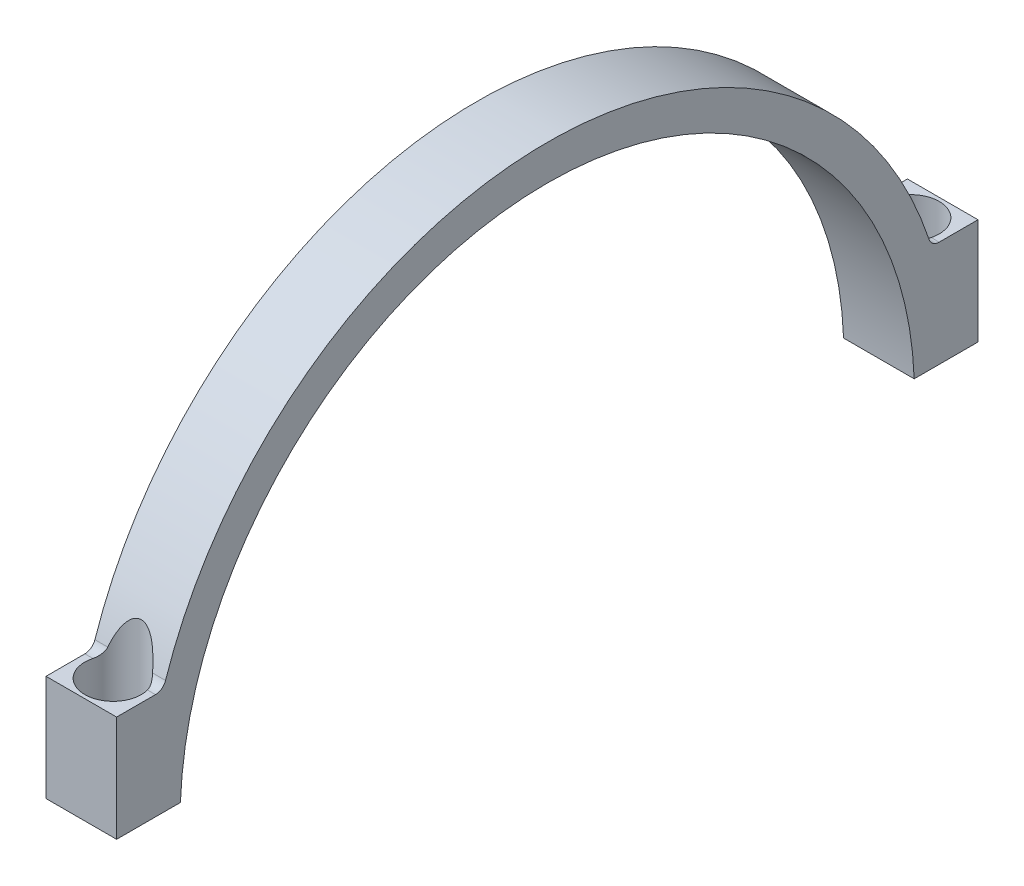
ISO-10303-21;
HEADER;
FILE_DESCRIPTION(('STEP AP214'),'2;1');
FILE_NAME('part.step','',(''),(''),'','','');
FILE_SCHEMA(('AUTOMOTIVE_DESIGN { 1 0 10303 214 1 1 1 1 }'));
ENDSEC;
DATA;
#1=APPLICATION_CONTEXT('core data for automotive mechanical design processes');
#2=APPLICATION_PROTOCOL_DEFINITION('international standard','automotive_design',2000,#1);
#3=PRODUCT_CONTEXT('',#1,'mechanical');
#4=PRODUCT('Part','Part','',(#3));
#5=PRODUCT_RELATED_PRODUCT_CATEGORY('part','',(#4));
#6=PRODUCT_DEFINITION_FORMATION('','',#4);
#7=PRODUCT_DEFINITION_CONTEXT('part definition',#1,'design');
#8=PRODUCT_DEFINITION('design','',#6,#7);
#9=PRODUCT_DEFINITION_SHAPE('','',#8);
#10=(LENGTH_UNIT() NAMED_UNIT(*) SI_UNIT(.MILLI.,.METRE.));
#11=(NAMED_UNIT(*) PLANE_ANGLE_UNIT() SI_UNIT($,.RADIAN.));
#12=(NAMED_UNIT(*) SI_UNIT($,.STERADIAN.) SOLID_ANGLE_UNIT());
#13=UNCERTAINTY_MEASURE_WITH_UNIT(LENGTH_MEASURE(1.E-05),#10,'distance_accuracy_value','');
#14=(GEOMETRIC_REPRESENTATION_CONTEXT(3) GLOBAL_UNCERTAINTY_ASSIGNED_CONTEXT((#13)) GLOBAL_UNIT_ASSIGNED_CONTEXT((#10,
#11,#12)) REPRESENTATION_CONTEXT('',''));
#15=CARTESIAN_POINT('',(0.,0.,0.));
#16=DIRECTION('',(0.,0.,1.));
#17=DIRECTION('',(1.,0.,0.));
#18=AXIS2_PLACEMENT_3D('',#15,#16,#17);
#19=CARTESIAN_POINT('',(10.,0.,0.));
#20=DIRECTION('',(-1.,0.,0.));
#21=DIRECTION('',(0.,0.,1.));
#22=AXIS2_PLACEMENT_3D('',#19,#20,#21);
#23=CYLINDRICAL_SURFACE('',#22,57.);
#24=CARTESIAN_POINT('',(8.98092758016828,10.025641025641,56.111376048222));
#25=CARTESIAN_POINT('',(8.97524254585746,10.3490713622826,56.053588763553));
#26=CARTESIAN_POINT('',(8.96805481656839,10.6719870166591,55.9930051983375));
#27=CARTESIAN_POINT('',(8.94976058895651,11.3166643216562,55.8662778867648));
#28=CARTESIAN_POINT('',(8.93865348228129,11.6384257852908,55.8001332784561));
#29=CARTESIAN_POINT('',(8.91154652247969,12.2820367910813,55.6620193673452));
#30=CARTESIAN_POINT('',(8.89552454178113,12.6038800159836,55.5900248274484));
#31=CARTESIAN_POINT('',(8.85749636690455,13.2459221938945,55.4405463037098));
#32=CARTESIAN_POINT('',(8.8354904962812,13.5661212348523,55.3630626168389));
#33=CARTESIAN_POINT('',(8.78320956776369,14.2168762276881,55.1996128747546));
#34=CARTESIAN_POINT('',(8.75264888002618,14.5473565570366,55.1134351428406));
#35=CARTESIAN_POINT('',(8.68191868541696,15.2057526458483,54.9354289710802));
#36=CARTESIAN_POINT('',(8.64174984273205,15.533668580964,54.8436009221513));
#37=CARTESIAN_POINT('',(8.54969791924612,16.1856723931647,54.6547251317632));
#38=CARTESIAN_POINT('',(8.49783734771407,16.5097663830818,54.557687689533));
#39=CARTESIAN_POINT('',(8.37957956653436,17.1537088465264,54.3586583542268));
#40=CARTESIAN_POINT('',(8.31318686901072,17.4735586052358,54.2566680066252));
#41=CARTESIAN_POINT('',(8.18269303008951,18.0209996596736,54.0768198967342));
#42=CARTESIAN_POINT('',(8.12291163055637,18.2499463327841,53.999972534325));
#43=CARTESIAN_POINT('',(7.99165982927601,18.7039838582036,53.8443923784483));
#44=CARTESIAN_POINT('',(7.92018369632461,18.9290727598937,53.7656586767778));
#45=CARTESIAN_POINT('',(7.7633055485129,19.3729962455112,53.6072965378473));
#46=CARTESIAN_POINT('',(7.67796140683117,19.591852559242,53.527673047525));
#47=CARTESIAN_POINT('',(7.53675791989153,19.9142384857343,53.4082041735898));
#48=CARTESIAN_POINT('',(7.48751004886755,20.0206843052548,53.3683883345541));
#49=CARTESIAN_POINT('',(7.38403035808135,20.2311869529735,53.2889454977621));
#50=CARTESIAN_POINT('',(7.32979950549739,20.3352442398972,53.2493184649233));
#51=CARTESIAN_POINT('',(7.21516721695251,20.5413105360856,53.1701688040216));
#52=CARTESIAN_POINT('',(7.15471536250559,20.6432932260039,53.1306502123442));
#53=CARTESIAN_POINT('',(7.0272311736767,20.8433727688584,53.0524771885857));
#54=CARTESIAN_POINT('',(6.96020161298035,20.9414712354097,53.0138224006262));
#55=CARTESIAN_POINT('',(6.81880572553038,21.1322858290206,52.9380485912646));
#56=CARTESIAN_POINT('',(6.74446772653375,21.225020684606,52.9009243746312));
#57=CARTESIAN_POINT('',(6.58717559617523,21.4037200098,52.8288749577424));
#58=CARTESIAN_POINT('',(6.50423039970049,21.4896913405724,52.7939475363862));
#59=CARTESIAN_POINT('',(6.33396517541467,21.6473645595326,52.7294832197916));
#60=CARTESIAN_POINT('',(6.24724455800938,21.7196229333219,52.6997457151229));
#61=CARTESIAN_POINT('',(6.06422866983195,21.8531619845964,52.6445109602995));
#62=CARTESIAN_POINT('',(5.96792702700321,21.9144352793096,52.6190165626397));
#63=CARTESIAN_POINT('',(5.76428986280238,22.0226487987764,52.5738189526262));
#64=CARTESIAN_POINT('',(5.65681921205717,22.0693772545294,52.554201447537));
#65=CARTESIAN_POINT('',(5.43399315777412,22.1421987156337,52.5235628506036));
#66=CARTESIAN_POINT('',(5.31866071173382,22.168349224203,52.5125178049863));
#67=CARTESIAN_POINT('',(5.10030753746703,22.1944433324742,52.5014938389054));
#68=CARTESIAN_POINT('',(4.99771937135538,22.1974408372296,52.5002254265597));
#69=CARTESIAN_POINT('',(4.79387489715627,22.1848713735368,52.5055380477562));
#70=CARTESIAN_POINT('',(4.69261906044374,22.1692980043123,52.51212178768));
#71=CARTESIAN_POINT('',(4.50787772608532,22.1246000329017,52.5309675487234));
#72=CARTESIAN_POINT('',(4.42379339269836,22.097500455146,52.542380054937));
#73=CARTESIAN_POINT('',(4.26063150587785,22.0327121814811,52.5695808850994));
#74=CARTESIAN_POINT('',(4.18155482755642,21.9950216409726,52.5853699712987));
#75=CARTESIAN_POINT('',(3.9770299988717,21.8825560239255,52.6323047521468));
#76=CARTESIAN_POINT('',(3.85660582437437,21.7999896044396,52.66659291475));
#77=CARTESIAN_POINT('',(3.63075103335253,21.6186631204135,52.7412843803095));
#78=CARTESIAN_POINT('',(3.52536993846674,21.5198517745996,52.781707016178));
#79=CARTESIAN_POINT('',(3.33648945205011,21.3205049891711,52.8625257804158));
#80=CARTESIAN_POINT('',(3.25188241054214,21.2208759661805,52.9026151003616));
#81=CARTESIAN_POINT('',(3.09206715498702,21.0150217454901,52.9847257129391));
#82=CARTESIAN_POINT('',(3.01686734074195,20.9087907777374,53.0267486870027));
#83=CARTESIAN_POINT('',(2.87444475631168,20.6912951252041,53.1119947243984));
#84=CARTESIAN_POINT('',(2.80723774014344,20.5800210773218,53.1552199571854));
#85=CARTESIAN_POINT('',(2.67986308205282,20.3538228002414,53.2422444177089));
#86=CARTESIAN_POINT('',(2.61969302544806,20.2388998404546,53.286043442782));
#87=CARTESIAN_POINT('',(2.48120773720007,19.956846290652,53.3924677572824));
#88=CARTESIAN_POINT('',(2.40600945553131,19.7882309356394,53.4552050609297));
#89=CARTESIAN_POINT('',(2.2657946226163,19.4466809276375,53.5804043927906));
#90=CARTESIAN_POINT('',(2.20078279109623,19.2737443152379,53.6428662804453));
#91=CARTESIAN_POINT('',(2.07927967777499,18.924348234637,53.7671226667859));
#92=CARTESIAN_POINT('',(2.02280206304054,18.7478836176181,53.8289159508737));
#93=CARTESIAN_POINT('',(1.9172230143836,18.3923739110792,53.9514221016094));
#94=CARTESIAN_POINT('',(1.86812285476312,18.2133283816002,54.0121347800122));
#95=CARTESIAN_POINT('',(1.77596302831119,17.8518527959993,54.1326880668143));
#96=CARTESIAN_POINT('',(1.73295063047803,17.6694075119301,54.1925189284882));
#97=CARTESIAN_POINT('',(1.65256532891645,17.3027920207816,54.3106849866416));
#98=CARTESIAN_POINT('',(1.61519294247169,17.1186216571267,54.369020045524));
#99=CARTESIAN_POINT('',(1.51053831706506,16.5643365645196,54.5414732666886));
#100=CARTESIAN_POINT('',(1.45062364784957,16.1920616475588,54.6531684032344));
#101=CARTESIAN_POINT('',(1.36493910096981,15.5780164661055,54.8305366447449));
#102=CARTESIAN_POINT('',(1.334638112181,15.3374511951775,54.8983170346388));
#103=CARTESIAN_POINT('',(1.27947524077091,14.8548621275284,55.0308611494224));
#104=CARTESIAN_POINT('',(1.25461352286283,14.6128382868665,55.0956247829113));
#105=CARTESIAN_POINT('',(1.18699974575501,13.8846575560271,55.2853321343324));
#106=CARTESIAN_POINT('',(1.15124977025878,13.3966229360885,55.4056253991491));
#107=CARTESIAN_POINT('',(1.10836995623634,12.6680718895512,55.5749948770484));
#108=CARTESIAN_POINT('',(1.09596440776749,12.4289555853743,55.6289600657094));
#109=CARTESIAN_POINT('',(1.07399420099027,11.9499138721701,55.733828710307));
#110=CARTESIAN_POINT('',(1.06442957607028,11.709988453667,55.7847321302541));
#111=CARTESIAN_POINT('',(1.04773228462032,11.2296917741017,55.8833970343595));
#112=CARTESIAN_POINT('',(1.04059690798491,10.9893213126563,55.9311619715097));
#113=CARTESIAN_POINT('',(1.02838269086794,10.507944338029,56.0235948257936));
#114=CARTESIAN_POINT('',(1.02330375715321,10.2669378541812,56.0682628832549));
#115=CARTESIAN_POINT('',(1.01907241983172,10.025641025641,56.111376048222));
#116=B_SPLINE_CURVE_WITH_KNOTS('',3,(#24,#25,#26,#27,#28,#29,#30,#31,#32,#33,#34,#35,#36,#37,
#38,#39,#40,#41,#42,#43,#44,#45,#46,#47,#48,#49,#50,#51,#52,#53,#54,#55,#56,#57,#58,#59,#60,#61,
#62,#63,#64,#65,#66,#67,#68,#69,#70,#71,#72,#73,#74,#75,#76,#77,#78,#79,#80,#81,#82,#83,#84,#85,
#86,#87,#88,#89,#90,#91,#92,#93,#94,#95,#96,#97,#98,#99,#100,#101,#102,#103,#104,#105,#106,#107,
#108,#109,#110,#111,#112,#113,#114,#115),.UNSPECIFIED.,.F.,.F.,(4,2,2,2,2,2,2,2,2,2,2,2,2,2,2,2,
2,2,2,2,2,2,2,2,2,2,2,2,2,2,2,2,2,2,2,2,2,2,2,2,2,2,2,2,2,4),(0.,0.985805225382937,
1.97176353145057,2.96222760353538,3.95263813092142,4.98116204101807,6.00961487246692,
7.03610435263616,8.06227556593926,8.80838801244502,9.55486720536636,10.2983076699961,
10.6697906223506,11.04120162294,11.4159036256788,11.7904482976316,12.1635945298997,
12.5363572127821,12.8857722342417,13.2354212148053,13.589945591596,13.9434757286652,
14.2494165026083,14.5554627548709,14.821719965159,15.0880235775157,15.5353767271489,
15.984170177356,16.3937170038214,16.8036269471762,17.2143318942025,17.6248954946736,
18.2094552679071,18.7942850915661,19.3800417814347,19.9658995325692,20.5560822951988,
21.1463191546363,22.325540486497,23.0807585744361,23.8359995288918,25.3472094161746,
26.0835186938778,26.8198366248205,27.5553303959298,28.2907908181412),.UNSPECIFIED.);
#117=CARTESIAN_POINT('',(8.17972681934575,18.025641025641,54.0747285301991));
#118=VERTEX_POINT('',#117);
#119=CARTESIAN_POINT('',(1.82027318065425,18.025641025641,54.0747285301991));
#120=VERTEX_POINT('',#119);
#121=EDGE_CURVE('E151',#118,#120,#116,.T.);
#122=ORIENTED_EDGE('',*,*,#121,.F.);
#123=DIRECTION('',(-1.,0.,0.));
#124=VECTOR('',#123,1.);
#125=CARTESIAN_POINT('',(10.,18.025641025641,54.0747285301991));
#126=LINE('',#125,#124);
#127=CARTESIAN_POINT('',(10.,18.025641025641,54.0747285301991));
#128=VERTEX_POINT('',#127);
#129=EDGE_CURVE('E150',#128,#118,#126,.T.);
#130=ORIENTED_EDGE('',*,*,#129,.F.);
#131=CARTESIAN_POINT('',(10.,0.,0.));
#132=DIRECTION('',(1.,0.,0.));
#133=DIRECTION('',(0.,0.,-1.));
#134=AXIS2_PLACEMENT_3D('',#131,#132,#133);
#135=CIRCLE('',#134,57.);
#136=CARTESIAN_POINT('',(10.,18.025641025641,-54.0747285301991));
#137=VERTEX_POINT('',#136);
#138=EDGE_CURVE('E494',#137,#128,#135,.T.);
#139=ORIENTED_EDGE('',*,*,#138,.F.);
#140=DIRECTION('',(-1.,0.,0.));
#141=VECTOR('',#140,1.);
#142=CARTESIAN_POINT('',(10.,18.025641025641,-54.0747285301991));
#143=LINE('',#142,#141);
#144=CARTESIAN_POINT('',(8.18205111576426,18.025641025641,-54.0747285301991));
#145=VERTEX_POINT('',#144);
#146=EDGE_CURVE('E165',#137,#145,#143,.T.);
#147=ORIENTED_EDGE('',*,*,#146,.T.);
#148=CARTESIAN_POINT('',(1.0187748364193,10.025641025641,-56.111376048222));
#149=CARTESIAN_POINT('',(1.02441520786975,10.3490741832487,-56.0535882558596));
#150=CARTESIAN_POINT('',(1.03155593580446,10.6719928694795,-55.993004102158));
#151=CARTESIAN_POINT('',(1.04975084595788,11.3166768112999,-55.8662753772873));
#152=CARTESIAN_POINT('',(1.06080563409151,11.6384418805096,-55.8001299464159));
#153=CARTESIAN_POINT('',(1.08780158857685,12.2820568228862,-55.6620149462381));
#154=CARTESIAN_POINT('',(1.10376479063743,12.6039004018115,-55.5900202120531));
#155=CARTESIAN_POINT('',(1.14166825336746,13.2459448280329,-55.4405409033176));
#156=CARTESIAN_POINT('',(1.16360819199843,13.5661457628911,-55.3630566247212));
#157=CARTESIAN_POINT('',(1.21574545102191,14.2169007720429,-55.1996065349017));
#158=CARTESIAN_POINT('',(1.24622792124905,14.5473793440816,-55.1134291273193));
#159=CARTESIAN_POINT('',(1.31678963554176,15.2057754228176,-54.9354226677808));
#160=CARTESIAN_POINT('',(1.35686821839138,15.533693104365,-54.8435940055456));
#161=CARTESIAN_POINT('',(1.44872428233727,16.1857072774306,-54.6547148392025));
#162=CARTESIAN_POINT('',(1.50047934248218,16.5098098559296,-54.5576746108294));
#163=CARTESIAN_POINT('',(1.61850510632784,17.1537778529621,-54.3586366681684));
#164=CARTESIAN_POINT('',(1.68477132491565,17.4736445483998,-54.2566404932287));
#165=CARTESIAN_POINT('',(1.81519189575711,18.0218469505562,-54.0765410140582));
#166=CARTESIAN_POINT('',(1.87506388022795,18.2515251924471,-53.9994423297759));
#167=CARTESIAN_POINT('',(2.00655510368844,18.7070100249652,-53.8433445156288));
#168=CARTESIAN_POINT('',(2.07818014482039,18.9328146421742,-53.7643444636347));
#169=CARTESIAN_POINT('',(2.2354352400144,19.37814693913,-53.6054381771533));
#170=CARTESIAN_POINT('',(2.3210075123636,19.5976963021096,-53.525536896485));
#171=CARTESIAN_POINT('',(2.46263332007853,19.921086162513,-53.4056511716983));
#172=CARTESIAN_POINT('',(2.51203507964,20.0278602590265,-53.3656965256611));
#173=CARTESIAN_POINT('',(2.61585462465286,20.2390037155718,-53.2859779368548));
#174=CARTESIAN_POINT('',(2.67027142852069,20.3433735412086,-53.2462139583629));
#175=CARTESIAN_POINT('',(2.78532327764997,20.5500591032935,-53.1667888538925));
#176=CARTESIAN_POINT('',(2.84600980896592,20.652347951774,-53.1271318634836));
#177=CARTESIAN_POINT('',(2.97401257742287,20.8530070492261,-53.0486916852541));
#178=CARTESIAN_POINT('',(3.04132598609591,20.9513789450586,-53.0099081332454));
#179=CARTESIAN_POINT('',(3.18334317922044,21.1426847318622,-52.9338967983024));
#180=CARTESIAN_POINT('',(3.2580178204408,21.2356379188587,-52.8966636494754));
#181=CARTESIAN_POINT('',(3.41605255692762,21.4147029785602,-52.8244242251364));
#182=CARTESIAN_POINT('',(3.49940346963889,21.5008219175065,-52.7894156571959));
#183=CARTESIAN_POINT('',(3.66997388572445,21.6581620995118,-52.7250484473787));
#184=CARTESIAN_POINT('',(3.75653046194243,21.7300011064805,-52.6954666812188));
#185=CARTESIAN_POINT('',(3.93915434553885,21.8627328793929,-52.6405363929303));
#186=CARTESIAN_POINT('',(4.03522790832129,21.9236183706938,-52.6151906849151));
#187=CARTESIAN_POINT('',(4.23831203756664,22.031110121602,-52.570273349693));
#188=CARTESIAN_POINT('',(4.34545532398441,22.0775075679559,-52.5507862984942));
#189=CARTESIAN_POINT('',(4.5675465173564,22.1498011318526,-52.5203570513585));
#190=CARTESIAN_POINT('',(4.68247208256213,22.1757534430242,-52.5093914353197));
#191=CARTESIAN_POINT('',(4.9003272391976,22.2016860215853,-52.4984314694027));
#192=CARTESIAN_POINT('',(5.00283656078455,22.2046437342803,-52.4971794161009));
#193=CARTESIAN_POINT('',(5.20651969095258,22.1920319006746,-52.5025119766));
#194=CARTESIAN_POINT('',(5.30769302903827,22.1764559945064,-52.5090992805001));
#195=CARTESIAN_POINT('',(5.4923831135869,22.1317612526894,-52.5279508720033));
#196=CARTESIAN_POINT('',(5.57649349925808,22.1046495587802,-52.5393728291734));
#197=CARTESIAN_POINT('',(5.7397054491825,22.039834554241,-52.5665952335806));
#198=CARTESIAN_POINT('',(5.81880611899763,22.0021293587361,-52.5823964600033));
#199=CARTESIAN_POINT('',(6.02339387113718,21.8896209809949,-52.6293668980761));
#200=CARTESIAN_POINT('',(6.14385477025056,21.8070243804387,-52.663680573384));
#201=CARTESIAN_POINT('',(6.36977662876179,21.6256333453852,-52.7384268209345));
#202=CARTESIAN_POINT('',(6.47518805713823,21.5267876279051,-52.7788787336032));
#203=CARTESIAN_POINT('',(6.66411704814045,21.327376664898,-52.8597538482076));
#204=CARTESIAN_POINT('',(6.7487432374413,21.2277184983136,-52.8998699143938));
#205=CARTESIAN_POINT('',(6.90859349280805,21.0218046235433,-52.9820350363507));
#206=CARTESIAN_POINT('',(6.98380915707207,20.9155431447458,-53.0240857742513));
#207=CARTESIAN_POINT('',(7.12626045170883,20.6979853695461,-53.109387949516));
#208=CARTESIAN_POINT('',(7.19348032663547,20.5866797104979,-53.1526415568583));
#209=CARTESIAN_POINT('',(7.32087802401505,20.3604173098031,-53.2397230451641));
#210=CARTESIAN_POINT('',(7.38105826135153,20.2454618374987,-53.2835507234268));
#211=CARTESIAN_POINT('',(7.51955243484306,19.963354770331,-53.3900346892041));
#212=CARTESIAN_POINT('',(7.59475012385538,19.7947189521125,-53.4528029587717));
#213=CARTESIAN_POINT('',(7.73496246804237,19.4531279858601,-53.578064134707));
#214=CARTESIAN_POINT('',(7.79997240419979,19.2801708789378,-53.6405569005112));
#215=CARTESIAN_POINT('',(7.92147030074047,18.9307336637327,-53.7648748714623));
#216=CARTESIAN_POINT('',(7.97794459501246,18.7542484075472,-53.8266988619799));
#217=CARTESIAN_POINT('',(8.08351559166722,18.3986971843563,-53.9492661480842));
#218=CARTESIAN_POINT('',(8.13261101955326,18.219630777368,-54.0100092553843));
#219=CARTESIAN_POINT('',(8.22476011507491,17.8581124665308,-54.130623461343));
#220=CARTESIAN_POINT('',(8.26776648348284,17.6756453263959,-54.1904848065467));
#221=CARTESIAN_POINT('',(8.34813837189788,17.3089858555632,-54.3087114165882));
#222=CARTESIAN_POINT('',(8.38550337447703,17.1247933682597,-54.3670765437854));
#223=CARTESIAN_POINT('',(8.49013397463965,16.5704415125739,-54.5396192375643));
#224=CARTESIAN_POINT('',(8.55003010361439,16.198121573162,-54.6513730928866));
#225=CARTESIAN_POINT('',(8.63571128300677,15.5837827369038,-54.8288992630383));
#226=CARTESIAN_POINT('',(8.66602294177705,15.3429675865137,-54.8967767886463));
#227=CARTESIAN_POINT('',(8.72119642634102,14.8598759499384,-55.0295087044609));
#228=CARTESIAN_POINT('',(8.74605808630126,14.6175994195166,-55.0943630026289));
#229=CARTESIAN_POINT('',(8.81365887603103,13.8886565016447,-55.2843325284614));
#230=CARTESIAN_POINT('',(8.84938303958545,13.4001089341659,-55.404787262798));
#231=CARTESIAN_POINT('',(8.89220834300939,12.6707964636144,-55.5743748788024));
#232=CARTESIAN_POINT('',(8.90459336119533,12.4314340568247,-55.6284073767888));
#233=CARTESIAN_POINT('',(8.92651877537105,11.9518988039653,-55.7334042041995));
#234=CARTESIAN_POINT('',(8.93605913785439,11.7117259483831,-55.7843684974786));
#235=CARTESIAN_POINT('',(8.95270526426463,11.2309340668115,-55.883148496071));
#236=CARTESIAN_POINT('',(8.95981374678355,10.9903158433598,-55.9309676686629));
#237=CARTESIAN_POINT('',(8.97197247287545,10.5084423381558,-56.0235025263775));
#238=CARTESIAN_POINT('',(8.97702280992456,10.2671870858369,-56.0682183523706));
#239=CARTESIAN_POINT('',(8.9812251635807,10.025641025641,-56.111376048222));
#240=B_SPLINE_CURVE_WITH_KNOTS('',3,(#148,#149,#150,#151,#152,#153,#154,#155,#156,#157,#158,
#159,#160,#161,#162,#163,#164,#165,#166,#167,#168,#169,#170,#171,#172,#173,#174,#175,#176,#177,
#178,#179,#180,#181,#182,#183,#184,#185,#186,#187,#188,#189,#190,#191,#192,#193,#194,#195,#196,
#197,#198,#199,#200,#201,#202,#203,#204,#205,#206,#207,#208,#209,#210,#211,#212,#213,#214,#215,
#216,#217,#218,#219,#220,#221,#222,#223,#224,#225,#226,#227,#228,#229,#230,#231,#232,#233,#234,
#235,#236,#237,#238,#239),.UNSPECIFIED.,.F.,.F.,(4,2,2,2,2,2,2,2,2,2,2,2,2,2,2,2,2,2,2,2,2,2,2,
2,2,2,2,2,2,2,2,2,2,2,2,2,2,2,2,2,2,2,2,2,2,4),(0.,0.985811490569731,1.97177565616599,
2.96223245867583,3.95263590395046,4.98113386364967,6.00956097553075,7.03602987926889,
8.06218196838049,8.81061056542374,9.5594097576603,10.3051821363057,10.6778279463738,
11.0504009735765,11.4263221550183,11.8020835766259,12.1764129301936,12.5503500634854,
12.8985059585049,13.2468922301967,13.6000898302466,13.9523132434667,14.2580186896098,
14.5638290697647,14.8301741490609,15.0965666485084,15.5440746714988,15.9930231662031,
16.4026926169376,16.8127252530824,17.2235529113035,17.6342392229633,18.2188812934343,
18.8037933775947,19.3896322431636,19.9755721803239,20.5658395653985,21.1561610571492,
22.335551653209,23.0915680996481,23.8476075470886,25.3604165336493,26.0974863277402,
26.8345648032334,27.5708165874081,28.3070349290278),.UNSPECIFIED.);
#241=CARTESIAN_POINT('',(1.81794888423574,18.025641025641,-54.0747285301991));
#242=VERTEX_POINT('',#241);
#243=EDGE_CURVE('E46',#242,#145,#240,.T.);
#244=ORIENTED_EDGE('',*,*,#243,.F.);
#245=CARTESIAN_POINT('',(0.,18.025641025641,-54.0747285301991));
#246=VERTEX_POINT('',#245);
#247=EDGE_CURVE('E164',#242,#246,#143,.T.);
#248=ORIENTED_EDGE('',*,*,#247,.T.);
#249=CARTESIAN_POINT('',(0.,0.,0.));
#250=DIRECTION('',(1.,0.,0.));
#251=DIRECTION('',(0.,0.,-1.));
#252=AXIS2_PLACEMENT_3D('',#249,#250,#251);
#253=CIRCLE('',#252,57.);
#254=CARTESIAN_POINT('',(0.,18.025641025641,54.0747285301991));
#255=VERTEX_POINT('',#254);
#256=EDGE_CURVE('E473',#246,#255,#253,.T.);
#257=ORIENTED_EDGE('',*,*,#256,.T.);
#258=EDGE_CURVE('E156',#120,#255,#126,.T.);
#259=ORIENTED_EDGE('',*,*,#258,.F.);
#260=EDGE_LOOP('',(#122,#130,#139,#147,#244,#248,#257,#259));
#261=FACE_BOUND('',#260,.T.);
#262=ADVANCED_FACE('F38',(#261),#23,.T.);
#263=CARTESIAN_POINT('',(10.,18.5,55.4977477020464));
#264=DIRECTION('',(-1.,0.,0.));
#265=DIRECTION('',(0.,0.,1.));
#266=AXIS2_PLACEMENT_3D('',#263,#264,#265);
#267=CYLINDRICAL_SURFACE('',#266,1.5);
#268=CARTESIAN_POINT('',(8.87200628716161,17.,55.4977477020464));
#269=CARTESIAN_POINT('',(8.86062879508625,16.9999991716232,55.4538421280466));
#270=CARTESIAN_POINT('',(8.84850299289162,17.0019282831981,55.4101623379998));
#271=CARTESIAN_POINT('',(8.82288388353367,17.0095140554363,55.3235638823198));
#272=CARTESIAN_POINT('',(8.80939149684986,17.0151682209892,55.2806447269464));
#273=CARTESIAN_POINT('',(8.7672034875608,17.0374343124166,55.1539148664426));
#274=CARTESIAN_POINT('',(8.73665707137537,17.0593532352405,55.071596635952));
#275=CARTESIAN_POINT('',(8.67216840283131,17.1159930777953,54.9132892947347));
#276=CARTESIAN_POINT('',(8.63823475924656,17.1506821165753,54.8372849953705));
#277=CARTESIAN_POINT('',(8.56845506421632,17.2317490608619,54.6924909644852));
#278=CARTESIAN_POINT('',(8.53260454322466,17.278155315621,54.6237193120186));
#279=CARTESIAN_POINT('',(8.45784569305229,17.3861011706645,54.489130436871));
#280=CARTESIAN_POINT('',(8.41894050404984,17.448601217201,54.4240804919989));
#281=CARTESIAN_POINT('',(8.34410078101479,17.5851089821285,54.3056469273346));
#282=CARTESIAN_POINT('',(8.30815798741446,17.6590829243026,54.2522301379835));
#283=CARTESIAN_POINT('',(8.2569615154647,17.7829982170628,54.1791876162871));
#284=CARTESIAN_POINT('',(8.23951619606519,17.8293699505879,54.1549787789604));
#285=CARTESIAN_POINT('',(8.20737096383175,17.9252397789867,54.1112304404529));
#286=CARTESIAN_POINT('',(8.19267480719459,17.9747420293895,54.0916973176912));
#287=CARTESIAN_POINT('',(8.17972681934575,18.025641025641,54.0747285301991));
#288=B_SPLINE_CURVE_WITH_KNOTS('',3,(#268,#269,#270,#271,#272,#273,#274,#275,#276,#277,#278,
#279,#280,#281,#282,#283,#284,#285,#286,#287),.UNSPECIFIED.,.F.,.F.,(4,2,2,2,2,2,2,2,2,4),(0.,
0.135964152232955,0.271837325616759,0.541947160340611,0.811387181496328,1.0814854536012,
1.37489540327244,1.66745747139685,1.83256608429145,1.9978986641673),.UNSPECIFIED.);
#289=CARTESIAN_POINT('',(8.87200628716161,17.,55.4977477020464));
#290=VERTEX_POINT('',#289);
#291=EDGE_CURVE('E137',#290,#118,#288,.T.);
#292=ORIENTED_EDGE('',*,*,#291,.F.);
#293=DIRECTION('',(-1.,0.,0.));
#294=VECTOR('',#293,1.);
#295=CARTESIAN_POINT('',(10.,17.,55.4977477020464));
#296=LINE('',#295,#294);
#297=CARTESIAN_POINT('',(10.,17.,55.4977477020464));
#298=VERTEX_POINT('',#297);
#299=EDGE_CURVE('E147',#298,#290,#296,.T.);
#300=ORIENTED_EDGE('',*,*,#299,.F.);
#301=CARTESIAN_POINT('',(10.,18.5,55.4977477020464));
#302=DIRECTION('',(-1.,0.,0.));
#303=DIRECTION('',(0.,0.,-1.));
#304=AXIS2_PLACEMENT_3D('',#301,#302,#303);
#305=CIRCLE('',#304,1.5);
#306=EDGE_CURVE('E496',#128,#298,#305,.T.);
#307=ORIENTED_EDGE('',*,*,#306,.F.);
#308=ORIENTED_EDGE('',*,*,#129,.T.);
#309=EDGE_LOOP('',(#292,#300,#307,#308));
#310=FACE_BOUND('',#309,.T.);
#311=ADVANCED_FACE('F145',(#310),#267,.F.);
#312=CARTESIAN_POINT('',(1.82027318065425,18.025641025641,54.0747285301991));
#313=CARTESIAN_POINT('',(1.799267726464,17.9431945760372,54.1022338427019));
#314=CARTESIAN_POINT('',(1.77376495193063,17.8645236382107,54.136389520449));
#315=CARTESIAN_POINT('',(1.71681920006215,17.7160999316034,54.2161207033036));
#316=CARTESIAN_POINT('',(1.6854085163046,17.6463019838902,54.2616345453246));
#317=CARTESIAN_POINT('',(1.61957288923076,17.5164033038176,54.3622900243501));
#318=CARTESIAN_POINT('',(1.58516294307606,17.4562581643508,54.4173849913306));
#319=CARTESIAN_POINT('',(1.51533976761615,17.3457391925537,54.5363502903054));
#320=CARTESIAN_POINT('',(1.47992441984957,17.2953880684639,54.6002404429934));
#321=CARTESIAN_POINT('',(1.40587838647596,17.2000524520006,54.7438080888564));
#322=CARTESIAN_POINT('',(1.36736994027898,17.1564307249514,54.8244598727657));
#323=CARTESIAN_POINT('',(1.29396854726487,17.0842786982541,54.9936164662308));
#324=CARTESIAN_POINT('',(1.25906722082867,17.0557127590716,55.0821021458814));
#325=CARTESIAN_POINT('',(1.20843336513938,17.023849682262,55.2259295459199));
#326=CARTESIAN_POINT('',(1.19084441052089,17.0149743745217,55.2794298706075));
#327=CARTESIAN_POINT('',(1.15776998401715,17.0030453064096,55.3877465093051));
#328=CARTESIAN_POINT('',(1.14228582205215,16.9999951560638,55.4425636180748));
#329=CARTESIAN_POINT('',(1.1279937128384,17.,55.4977477020464));
#330=B_SPLINE_CURVE_WITH_KNOTS('',3,(#312,#313,#314,#315,#316,#317,#318,#319,#320,#321,#322,
#323,#324,#325,#326,#327,#328,#329),.UNSPECIFIED.,.F.,.F.,(4,2,2,2,2,2,2,2,4),(0.,
0.267274653879452,0.533128701403943,0.797722291822737,1.06292223716004,1.35985053843083,
1.65607276822136,1.82678994061544,1.99761287731011),.UNSPECIFIED.);
#331=CARTESIAN_POINT('',(1.1279937128384,17.,55.4977477020464));
#332=VERTEX_POINT('',#331);
#333=EDGE_CURVE('E52',#120,#332,#330,.T.);
#334=ORIENTED_EDGE('',*,*,#333,.F.);
#335=ORIENTED_EDGE('',*,*,#258,.T.);
#336=CARTESIAN_POINT('',(0.,18.5,55.4977477020464));
#337=DIRECTION('',(-1.,0.,0.));
#338=DIRECTION('',(0.,0.,-1.));
#339=AXIS2_PLACEMENT_3D('',#336,#337,#338);
#340=CIRCLE('',#339,1.5);
#341=CARTESIAN_POINT('',(0.,17.,55.4977477020464));
#342=VERTEX_POINT('',#341);
#343=EDGE_CURVE('E414',#255,#342,#340,.T.);
#344=ORIENTED_EDGE('',*,*,#343,.T.);
#345=EDGE_CURVE('E157',#332,#342,#296,.T.);
#346=ORIENTED_EDGE('',*,*,#345,.F.);
#347=EDGE_LOOP('',(#334,#335,#344,#346));
#348=FACE_BOUND('',#347,.T.);
#349=ADVANCED_FACE('F228',(#348),#267,.F.);
#350=CARTESIAN_POINT('',(10.,17.,61.0015242270663));
#351=DIRECTION('',(0.,-1.,0.));
#352=DIRECTION('',(0.,0.,-1.));
#353=AXIS2_PLACEMENT_3D('',#350,#351,#352);
#354=PLANE('',#353);
#355=CARTESIAN_POINT('',(5.,17.,56.5015242270663));
#356=DIRECTION('',(0.,-1.,0.));
#357=DIRECTION('',(0.,0.,-1.));
#358=AXIS2_PLACEMENT_3D('',#355,#356,#357);
#359=CIRCLE('',#358,4.);
#360=EDGE_CURVE('E11',#332,#290,#359,.F.);
#361=ORIENTED_EDGE('',*,*,#360,.F.);
#362=ORIENTED_EDGE('',*,*,#345,.T.);
#363=DIRECTION('',(0.,0.,1.));
#364=VECTOR('',#363,1.);
#365=CARTESIAN_POINT('',(0.,17.,61.0015242270663));
#366=LINE('',#365,#364);
#367=CARTESIAN_POINT('',(0.,17.,61.0015242270663));
#368=VERTEX_POINT('',#367);
#369=EDGE_CURVE('E416',#342,#368,#366,.T.);
#370=ORIENTED_EDGE('',*,*,#369,.T.);
#371=DIRECTION('',(-1.,0.,0.));
#372=VECTOR('',#371,1.);
#373=CARTESIAN_POINT('',(10.,17.,61.0015242270663));
#374=LINE('',#373,#372);
#375=CARTESIAN_POINT('',(10.,17.,61.0015242270663));
#376=VERTEX_POINT('',#375);
#377=EDGE_CURVE('E160',#376,#368,#374,.T.);
#378=ORIENTED_EDGE('',*,*,#377,.F.);
#379=DIRECTION('',(0.,0.,1.));
#380=VECTOR('',#379,1.);
#381=CARTESIAN_POINT('',(10.,17.,61.0015242270663));
#382=LINE('',#381,#380);
#383=EDGE_CURVE('E155',#298,#376,#382,.T.);
#384=ORIENTED_EDGE('',*,*,#383,.F.);
#385=ORIENTED_EDGE('',*,*,#299,.T.);
#386=EDGE_LOOP('',(#361,#362,#370,#378,#384,#385));
#387=FACE_BOUND('',#386,.T.);
#388=ADVANCED_FACE('F153',(#387),#354,.F.);
#389=CARTESIAN_POINT('',(5.,16.9999999999999,56.5015242270663));
#390=DIRECTION('',(0.,1.,0.));
#391=DIRECTION('',(0.,0.,1.));
#392=AXIS2_PLACEMENT_3D('',#389,#390,#391);
#393=CYLINDRICAL_SURFACE('',#392,1.64999999999999);
#394=CARTESIAN_POINT('',(5.,2.,56.5015242270663));
#395=DIRECTION('',(0.,1.,0.));
#396=DIRECTION('',(0.,0.,1.));
#397=AXIS2_PLACEMENT_3D('',#394,#395,#396);
#398=CIRCLE('',#397,1.64999999999999);
#399=CARTESIAN_POINT('',(5.,2.,58.1515242270663));
#400=VERTEX_POINT('',#399);
#401=EDGE_CURVE('E290',#400,#400,#398,.T.);
#402=ORIENTED_EDGE('',*,*,#401,.F.);
#403=EDGE_LOOP('',(#402));
#404=FACE_BOUND('',#403,.T.);
#405=CARTESIAN_POINT('',(5.,10.3999999999999,56.5015242270663));
#406=DIRECTION('',(0.,1.,0.));
#407=DIRECTION('',(0.,0.,1.));
#408=AXIS2_PLACEMENT_3D('',#405,#406,#407);
#409=CIRCLE('',#408,1.64999999999999);
#410=CARTESIAN_POINT('',(5.,10.3999999999999,58.1515242270663));
#411=VERTEX_POINT('',#410);
#412=EDGE_CURVE('E181',#411,#411,#409,.F.);
#413=ORIENTED_EDGE('',*,*,#412,.F.);
#414=EDGE_LOOP('',(#413));
#415=FACE_BOUND('',#414,.T.);
#416=ADVANCED_FACE('F220',(#404,#415),#393,.F.);
#417=CARTESIAN_POINT('',(10.,17.,-60.9984757729337));
#418=DIRECTION('',(0.,-1.,0.));
#419=DIRECTION('',(0.,0.,-1.));
#420=AXIS2_PLACEMENT_3D('',#417,#418,#419);
#421=PLANE('',#420);
#422=CARTESIAN_POINT('',(5.,17.,-56.4984757729337));
#423=DIRECTION('',(0.,-1.,0.));
#424=DIRECTION('',(0.,0.,-1.));
#425=AXIS2_PLACEMENT_3D('',#422,#423,#424);
#426=CIRCLE('',#425,4.);
#427=CARTESIAN_POINT('',(8.87279528611291,17.,-55.4977477020464));
#428=VERTEX_POINT('',#427);
#429=CARTESIAN_POINT('',(1.12720471388709,17.,-55.4977477020464));
#430=VERTEX_POINT('',#429);
#431=EDGE_CURVE('E493',#428,#430,#426,.F.);
#432=ORIENTED_EDGE('',*,*,#431,.F.);
#433=DIRECTION('',(-1.,0.,0.));
#434=VECTOR('',#433,1.);
#435=CARTESIAN_POINT('',(10.,17.,-55.4977477020464));
#436=LINE('',#435,#434);
#437=CARTESIAN_POINT('',(10.,17.,-55.4977477020464));
#438=VERTEX_POINT('',#437);
#439=EDGE_CURVE('E169',#438,#428,#436,.T.);
#440=ORIENTED_EDGE('',*,*,#439,.F.);
#441=DIRECTION('',(0.,0.,1.));
#442=VECTOR('',#441,1.);
#443=CARTESIAN_POINT('',(10.,17.,-60.9984757729337));
#444=LINE('',#443,#442);
#445=CARTESIAN_POINT('',(10.,17.,-60.9984757729337));
#446=VERTEX_POINT('',#445);
#447=EDGE_CURVE('E440',#446,#438,#444,.T.);
#448=ORIENTED_EDGE('',*,*,#447,.F.);
#449=DIRECTION('',(-1.,0.,0.));
#450=VECTOR('',#449,1.);
#451=CARTESIAN_POINT('',(10.,17.,-60.9984757729337));
#452=LINE('',#451,#450);
#453=CARTESIAN_POINT('',(0.,17.,-60.9984757729337));
#454=VERTEX_POINT('',#453);
#455=EDGE_CURVE('E441',#446,#454,#452,.T.);
#456=ORIENTED_EDGE('',*,*,#455,.T.);
#457=DIRECTION('',(0.,0.,1.));
#458=VECTOR('',#457,1.);
#459=CARTESIAN_POINT('',(0.,17.,-60.9984757729337));
#460=LINE('',#459,#458);
#461=CARTESIAN_POINT('',(0.,17.,-55.4977477020464));
#462=VERTEX_POINT('',#461);
#463=EDGE_CURVE('E467',#454,#462,#460,.T.);
#464=ORIENTED_EDGE('',*,*,#463,.T.);
#465=EDGE_CURVE('E168',#430,#462,#436,.T.);
#466=ORIENTED_EDGE('',*,*,#465,.F.);
#467=EDGE_LOOP('',(#432,#440,#448,#456,#464,#466));
#468=FACE_BOUND('',#467,.T.);
#469=ADVANCED_FACE('F40',(#468),#421,.F.);
#470=CARTESIAN_POINT('',(10.,18.5,-55.4977477020464));
#471=DIRECTION('',(-1.,0.,0.));
#472=DIRECTION('',(0.,0.,1.));
#473=AXIS2_PLACEMENT_3D('',#470,#471,#472);
#474=CYLINDRICAL_SURFACE('',#473,1.5);
#475=CARTESIAN_POINT('',(8.18205111576425,18.025641025641,-54.0747285301991));
#476=CARTESIAN_POINT('',(8.20301237634348,17.9432022622896,-54.1022308700428));
#477=CARTESIAN_POINT('',(8.22846350293831,17.8645337790114,-54.1363846464575));
#478=CARTESIAN_POINT('',(8.28529704503494,17.7161075986878,-54.2161160134833));
#479=CARTESIAN_POINT('',(8.31664730192159,17.6463048740333,-54.2616320835573));
#480=CARTESIAN_POINT('',(8.38235865546619,17.5163936583968,-54.3622977198602));
#481=CARTESIAN_POINT('',(8.41670482554797,17.4562409193368,-54.4174007502935));
#482=CARTESIAN_POINT('',(8.48639715553467,17.3457087996646,-54.5363858159031));
#483=CARTESIAN_POINT('',(8.52174542104478,17.295352064741,-54.6002876229704));
#484=CARTESIAN_POINT('',(8.59563032838337,17.2000293435609,-54.7438507739908));
#485=CARTESIAN_POINT('',(8.63404489191852,17.1564210432955,-54.8244826850983));
#486=CARTESIAN_POINT('',(8.70725938166015,17.0842886585277,-54.9935930011747));
#487=CARTESIAN_POINT('',(8.74206767186889,17.0557290126726,-55.0820523256872));
#488=CARTESIAN_POINT('',(8.79256881519019,17.0238612228495,-55.2258638752746));
#489=CARTESIAN_POINT('',(8.81011575597113,17.0149814738379,-55.2793782157072));
#490=CARTESIAN_POINT('',(8.84310523763157,17.0030466229718,-55.3877217353931));
#491=CARTESIAN_POINT('',(8.85854647200514,16.9999951221787,-55.4425517063586));
#492=CARTESIAN_POINT('',(8.87279528611291,17.,-55.4977477020464));
#493=B_SPLINE_CURVE_WITH_KNOTS('',3,(#475,#476,#477,#478,#479,#480,#481,#482,#483,#484,#485,
#486,#487,#488,#489,#490,#491,#492),.UNSPECIFIED.,.F.,.F.,(4,2,2,2,2,2,2,2,4),(0.,
0.267221700416605,0.533026787034921,0.7975759089193,1.062729512218,1.35948345011011,
1.65553295009819,1.82625249362959,1.99707748444206),.UNSPECIFIED.);
#494=EDGE_CURVE('E203',#145,#428,#493,.T.);
#495=ORIENTED_EDGE('',*,*,#494,.F.);
#496=ORIENTED_EDGE('',*,*,#146,.F.);
#497=CARTESIAN_POINT('',(10.,18.5,-55.4977477020464));
#498=DIRECTION('',(-1.,0.,0.));
#499=DIRECTION('',(0.,0.,1.));
#500=AXIS2_PLACEMENT_3D('',#497,#498,#499);
#501=CIRCLE('',#500,1.5);
#502=EDGE_CURVE('E490',#438,#137,#501,.T.);
#503=ORIENTED_EDGE('',*,*,#502,.F.);
#504=ORIENTED_EDGE('',*,*,#439,.T.);
#505=EDGE_LOOP('',(#495,#496,#503,#504));
#506=FACE_BOUND('',#505,.T.);
#507=ADVANCED_FACE('F209',(#506),#474,.F.);
#508=CARTESIAN_POINT('',(1.12720471388709,17.,-55.4977477020464));
#509=CARTESIAN_POINT('',(1.1385418594383,16.9999991674859,-55.4538555709318));
#510=CARTESIAN_POINT('',(1.15062673243832,17.0019271052583,-55.4101883932533));
#511=CARTESIAN_POINT('',(1.17616317474867,17.0095086163689,-55.3236133828928));
#512=CARTESIAN_POINT('',(1.18961382603149,17.0151597009802,-55.2807050626149));
#513=CARTESIAN_POINT('',(1.23167654196134,17.0374144749077,-55.154004303863));
#514=CARTESIAN_POINT('',(1.26213864337333,17.0593230715691,-55.0717017758472));
#515=CARTESIAN_POINT('',(1.3264594805112,17.1159390847975,-54.9134194036094));
#516=CARTESIAN_POINT('',(1.36030962846166,17.1506147100713,-54.8374244240607));
#517=CARTESIAN_POINT('',(1.42992398769708,17.2316519262402,-54.6926454218702));
#518=CARTESIAN_POINT('',(1.465692660532,17.2780417768101,-54.6238794150482));
#519=CARTESIAN_POINT('',(1.54027797388984,17.3859394935982,-54.4893119064413));
#520=CARTESIAN_POINT('',(1.5790918469317,17.4484052076041,-54.4242756005687));
#521=CARTESIAN_POINT('',(1.65376021103191,17.584833459708,-54.3058611122888));
#522=CARTESIAN_POINT('',(1.68962289851094,17.6587623890391,-54.2524499131493));
#523=CARTESIAN_POINT('',(1.74074584140823,17.7826809514138,-54.1793573118062));
#524=CARTESIAN_POINT('',(1.75818650666313,17.8291120145262,-54.1551048126908));
#525=CARTESIAN_POINT('',(1.79032020770572,17.9251066641275,-54.1112828795308));
#526=CARTESIAN_POINT('',(1.80500949375376,17.9746744042139,-54.0917198265287));
#527=CARTESIAN_POINT('',(1.81794888423575,18.025641025641,-54.0747285301991));
#528=B_SPLINE_CURVE_WITH_KNOTS('',3,(#508,#509,#510,#511,#512,#513,#514,#515,#516,#517,#518,
#519,#520,#521,#522,#523,#524,#525,#526,#527),.UNSPECIFIED.,.F.,.F.,(4,2,2,2,2,2,2,2,2,4),(0.,
0.135894896960388,0.271699047397034,0.541673738458158,0.810980660275532,1.0809435770665,
1.37415349491585,1.6665194678003,1.83182970154525,1.99736361600335),.UNSPECIFIED.);
#529=EDGE_CURVE('E60',#430,#242,#528,.T.);
#530=ORIENTED_EDGE('',*,*,#529,.F.);
#531=ORIENTED_EDGE('',*,*,#465,.T.);
#532=CARTESIAN_POINT('',(0.,18.5,-55.4977477020464));
#533=DIRECTION('',(-1.,0.,0.));
#534=DIRECTION('',(0.,0.,1.));
#535=AXIS2_PLACEMENT_3D('',#532,#533,#534);
#536=CIRCLE('',#535,1.5);
#537=EDGE_CURVE('E470',#462,#246,#536,.T.);
#538=ORIENTED_EDGE('',*,*,#537,.T.);
#539=ORIENTED_EDGE('',*,*,#247,.F.);
#540=EDGE_LOOP('',(#530,#531,#538,#539));
#541=FACE_BOUND('',#540,.T.);
#542=ADVANCED_FACE('F212',(#541),#474,.F.);
#543=CARTESIAN_POINT('',(5.,17.,-56.4984757729337));
#544=DIRECTION('',(0.,1.,0.));
#545=DIRECTION('',(0.,0.,1.));
#546=AXIS2_PLACEMENT_3D('',#543,#544,#545);
#547=CYLINDRICAL_SURFACE('',#546,1.64999999999999);
#548=CARTESIAN_POINT('',(5.,2.,-56.4984757729337));
#549=DIRECTION('',(0.,1.,0.));
#550=DIRECTION('',(0.,0.,1.));
#551=AXIS2_PLACEMENT_3D('',#548,#549,#550);
#552=CIRCLE('',#551,1.64999999999999);
#553=CARTESIAN_POINT('',(5.,2.,-54.8484757729337));
#554=VERTEX_POINT('',#553);
#555=EDGE_CURVE('E500',#554,#554,#552,.T.);
#556=ORIENTED_EDGE('',*,*,#555,.F.);
#557=EDGE_LOOP('',(#556));
#558=FACE_BOUND('',#557,.T.);
#559=CARTESIAN_POINT('',(5.,10.4000000000001,-56.4984757729337));
#560=DIRECTION('',(0.,1.,0.));
#561=DIRECTION('',(0.,0.,1.));
#562=AXIS2_PLACEMENT_3D('',#559,#560,#561);
#563=CIRCLE('',#562,1.64999999999999);
#564=CARTESIAN_POINT('',(5.,10.4,-54.8484757729337));
#565=VERTEX_POINT('',#564);
#566=EDGE_CURVE('E172',#565,#565,#563,.F.);
#567=ORIENTED_EDGE('',*,*,#566,.F.);
#568=EDGE_LOOP('',(#567));
#569=FACE_BOUND('',#568,.T.);
#570=ADVANCED_FACE('F193',(#558,#569),#547,.F.);
#571=CARTESIAN_POINT('',(10.,2.,61.0015242270663));
#572=DIRECTION('',(0.,0.,-1.));
#573=DIRECTION('',(-1.,0.,0.));
#574=AXIS2_PLACEMENT_3D('',#571,#572,#573);
#575=PLANE('',#574);
#576=DIRECTION('',(0.,-1.,0.));
#577=VECTOR('',#576,1.);
#578=CARTESIAN_POINT('',(0.,2.,61.0015242270663));
#579=LINE('',#578,#577);
#580=CARTESIAN_POINT('',(0.,2.,61.0015242270663));
#581=VERTEX_POINT('',#580);
#582=EDGE_CURVE('E420',#368,#581,#579,.T.);
#583=ORIENTED_EDGE('',*,*,#582,.T.);
#584=DIRECTION('',(-1.,0.,0.));
#585=VECTOR('',#584,1.);
#586=CARTESIAN_POINT('',(10.,2.,61.0015242270663));
#587=LINE('',#586,#585);
#588=CARTESIAN_POINT('',(10.,2.,61.0015242270663));
#589=VERTEX_POINT('',#588);
#590=EDGE_CURVE('E425',#589,#581,#587,.T.);
#591=ORIENTED_EDGE('',*,*,#590,.F.);
#592=DIRECTION('',(0.,-1.,0.));
#593=VECTOR('',#592,1.);
#594=CARTESIAN_POINT('',(10.,2.,61.0015242270663));
#595=LINE('',#594,#593);
#596=EDGE_CURVE('E424',#376,#589,#595,.T.);
#597=ORIENTED_EDGE('',*,*,#596,.F.);
#598=ORIENTED_EDGE('',*,*,#377,.T.);
#599=EDGE_LOOP('',(#583,#591,#597,#598));
#600=FACE_BOUND('',#599,.T.);
#601=ADVANCED_FACE('F257',(#600),#575,.F.);
#602=CARTESIAN_POINT('',(10.,2.,61.0015242270663));
#603=DIRECTION('',(0.,1.,0.));
#604=DIRECTION('',(0.,0.,1.));
#605=AXIS2_PLACEMENT_3D('',#602,#603,#604);
#606=PLANE('',#605);
#607=ORIENTED_EDGE('',*,*,#401,.T.);
#608=EDGE_LOOP('',(#607));
#609=FACE_BOUND('',#608,.T.);
#610=DIRECTION('',(0.,0.,-1.));
#611=VECTOR('',#610,1.);
#612=CARTESIAN_POINT('',(0.,2.,61.0015242270663));
#613=LINE('',#612,#611);
#614=CARTESIAN_POINT('',(0.,2.00000000000001,51.9615242270663));
#615=VERTEX_POINT('',#614);
#616=EDGE_CURVE('E429',#581,#615,#613,.T.);
#617=ORIENTED_EDGE('',*,*,#616,.T.);
#618=DIRECTION('',(-1.,0.,0.));
#619=VECTOR('',#618,1.);
#620=CARTESIAN_POINT('',(10.,2.00000000000001,51.9615242270663));
#621=LINE('',#620,#619);
#622=CARTESIAN_POINT('',(10.,2.00000000000001,51.9615242270663));
#623=VERTEX_POINT('',#622);
#624=EDGE_CURVE('E451',#623,#615,#621,.T.);
#625=ORIENTED_EDGE('',*,*,#624,.F.);
#626=DIRECTION('',(0.,0.,-1.));
#627=VECTOR('',#626,1.);
#628=CARTESIAN_POINT('',(10.,2.,61.0015242270663));
#629=LINE('',#628,#627);
#630=EDGE_CURVE('E456',#589,#623,#629,.T.);
#631=ORIENTED_EDGE('',*,*,#630,.F.);
#632=ORIENTED_EDGE('',*,*,#590,.T.);
#633=EDGE_LOOP('',(#617,#625,#631,#632));
#634=FACE_BOUND('',#633,.T.);
#635=ADVANCED_FACE('F260',(#609,#634),#606,.F.);
#636=CARTESIAN_POINT('',(10.,0.,0.));
#637=DIRECTION('',(-1.,0.,0.));
#638=DIRECTION('',(0.,0.,1.));
#639=AXIS2_PLACEMENT_3D('',#636,#637,#638);
#640=CYLINDRICAL_SURFACE('',#639,52.);
#641=CARTESIAN_POINT('',(0.,0.,0.));
#642=DIRECTION('',(-1.,0.,0.));
#643=DIRECTION('',(0.,0.,-1.));
#644=AXIS2_PLACEMENT_3D('',#641,#642,#643);
#645=CIRCLE('',#644,52.);
#646=CARTESIAN_POINT('',(0.,2.,-51.9615242270663));
#647=VERTEX_POINT('',#646);
#648=EDGE_CURVE('E431',#615,#647,#645,.T.);
#649=ORIENTED_EDGE('',*,*,#648,.T.);
#650=DIRECTION('',(-1.,0.,0.));
#651=VECTOR('',#650,1.);
#652=CARTESIAN_POINT('',(10.,2.,-51.9615242270663));
#653=LINE('',#652,#651);
#654=CARTESIAN_POINT('',(10.,2.,-51.9615242270663));
#655=VERTEX_POINT('',#654);
#656=EDGE_CURVE('E448',#655,#647,#653,.T.);
#657=ORIENTED_EDGE('',*,*,#656,.F.);
#658=CARTESIAN_POINT('',(10.,0.,0.));
#659=DIRECTION('',(-1.,0.,0.));
#660=DIRECTION('',(0.,0.,-1.));
#661=AXIS2_PLACEMENT_3D('',#658,#659,#660);
#662=CIRCLE('',#661,52.);
#663=EDGE_CURVE('E458',#623,#655,#662,.T.);
#664=ORIENTED_EDGE('',*,*,#663,.F.);
#665=ORIENTED_EDGE('',*,*,#624,.T.);
#666=EDGE_LOOP('',(#649,#657,#664,#665));
#667=FACE_BOUND('',#666,.T.);
#668=ADVANCED_FACE('F264',(#667),#640,.F.);
#669=CARTESIAN_POINT('',(10.,2.,-51.9615242270663));
#670=DIRECTION('',(0.,1.,0.));
#671=DIRECTION('',(0.,0.,1.));
#672=AXIS2_PLACEMENT_3D('',#669,#670,#671);
#673=PLANE('',#672);
#674=ORIENTED_EDGE('',*,*,#555,.T.);
#675=EDGE_LOOP('',(#674));
#676=FACE_BOUND('',#675,.T.);
#677=DIRECTION('',(0.,0.,-1.));
#678=VECTOR('',#677,1.);
#679=CARTESIAN_POINT('',(0.,2.,-51.9615242270663));
#680=LINE('',#679,#678);
#681=CARTESIAN_POINT('',(0.,2.,-60.9984757729337));
#682=VERTEX_POINT('',#681);
#683=EDGE_CURVE('E436',#647,#682,#680,.T.);
#684=ORIENTED_EDGE('',*,*,#683,.T.);
#685=DIRECTION('',(-1.,0.,0.));
#686=VECTOR('',#685,1.);
#687=CARTESIAN_POINT('',(10.,2.,-60.9984757729337));
#688=LINE('',#687,#686);
#689=CARTESIAN_POINT('',(10.,2.,-60.9984757729337));
#690=VERTEX_POINT('',#689);
#691=EDGE_CURVE('E444',#690,#682,#688,.T.);
#692=ORIENTED_EDGE('',*,*,#691,.F.);
#693=DIRECTION('',(0.,0.,-1.));
#694=VECTOR('',#693,1.);
#695=CARTESIAN_POINT('',(10.,2.,-51.9615242270663));
#696=LINE('',#695,#694);
#697=EDGE_CURVE('E460',#655,#690,#696,.T.);
#698=ORIENTED_EDGE('',*,*,#697,.F.);
#699=ORIENTED_EDGE('',*,*,#656,.T.);
#700=EDGE_LOOP('',(#684,#692,#698,#699));
#701=FACE_BOUND('',#700,.T.);
#702=ADVANCED_FACE('F268',(#676,#701),#673,.F.);
#703=CARTESIAN_POINT('',(10.,2.,-60.9984757729337));
#704=DIRECTION('',(0.,0.,1.));
#705=DIRECTION('',(1.,0.,0.));
#706=AXIS2_PLACEMENT_3D('',#703,#704,#705);
#707=PLANE('',#706);
#708=DIRECTION('',(0.,1.,0.));
#709=VECTOR('',#708,1.);
#710=CARTESIAN_POINT('',(0.,2.,-60.9984757729337));
#711=LINE('',#710,#709);
#712=EDGE_CURVE('E438',#682,#454,#711,.T.);
#713=ORIENTED_EDGE('',*,*,#712,.T.);
#714=ORIENTED_EDGE('',*,*,#455,.F.);
#715=DIRECTION('',(0.,1.,0.));
#716=VECTOR('',#715,1.);
#717=CARTESIAN_POINT('',(10.,2.,-60.9984757729337));
#718=LINE('',#717,#716);
#719=EDGE_CURVE('E445',#690,#446,#718,.T.);
#720=ORIENTED_EDGE('',*,*,#719,.F.);
#721=ORIENTED_EDGE('',*,*,#691,.T.);
#722=EDGE_LOOP('',(#713,#714,#720,#721));
#723=FACE_BOUND('',#722,.T.);
#724=ADVANCED_FACE('F272',(#723),#707,.F.);
#725=CARTESIAN_POINT('',(10.,18.5,-55.4977477020464));
#726=DIRECTION('',(-1.,0.,0.));
#727=DIRECTION('',(0.,0.,1.));
#728=AXIS2_PLACEMENT_3D('',#725,#726,#727);
#729=PLANE('',#728);
#730=ORIENTED_EDGE('',*,*,#447,.T.);
#731=ORIENTED_EDGE('',*,*,#502,.T.);
#732=ORIENTED_EDGE('',*,*,#138,.T.);
#733=ORIENTED_EDGE('',*,*,#306,.T.);
#734=ORIENTED_EDGE('',*,*,#383,.T.);
#735=ORIENTED_EDGE('',*,*,#596,.T.);
#736=ORIENTED_EDGE('',*,*,#630,.T.);
#737=ORIENTED_EDGE('',*,*,#663,.T.);
#738=ORIENTED_EDGE('',*,*,#697,.T.);
#739=ORIENTED_EDGE('',*,*,#719,.T.);
#740=EDGE_LOOP('',(#730,#731,#732,#733,#734,#735,#736,#737,#738,#739));
#741=FACE_BOUND('',#740,.T.);
#742=ADVANCED_FACE('F276',(#741),#729,.F.);
#743=CARTESIAN_POINT('',(0.,18.5,-55.4977477020464));
#744=DIRECTION('',(-1.,0.,0.));
#745=DIRECTION('',(0.,0.,1.));
#746=AXIS2_PLACEMENT_3D('',#743,#744,#745);
#747=PLANE('',#746);
#748=ORIENTED_EDGE('',*,*,#463,.F.);
#749=ORIENTED_EDGE('',*,*,#712,.F.);
#750=ORIENTED_EDGE('',*,*,#683,.F.);
#751=ORIENTED_EDGE('',*,*,#648,.F.);
#752=ORIENTED_EDGE('',*,*,#616,.F.);
#753=ORIENTED_EDGE('',*,*,#582,.F.);
#754=ORIENTED_EDGE('',*,*,#369,.F.);
#755=ORIENTED_EDGE('',*,*,#343,.F.);
#756=ORIENTED_EDGE('',*,*,#256,.F.);
#757=ORIENTED_EDGE('',*,*,#537,.F.);
#758=EDGE_LOOP('',(#748,#749,#750,#751,#752,#753,#754,#755,#756,#757));
#759=FACE_BOUND('',#758,.T.);
#760=ADVANCED_FACE('F190',(#759),#747,.T.);
#761=CARTESIAN_POINT('',(5.,27.0000000000001,-56.4984757729336));
#762=DIRECTION('',(0.,-1.,0.));
#763=DIRECTION('',(0.,0.,-1.));
#764=AXIS2_PLACEMENT_3D('',#761,#762,#763);
#765=CYLINDRICAL_SURFACE('',#764,4.);
#766=CARTESIAN_POINT('',(5.,10.4000000000001,-56.4984757729337));
#767=DIRECTION('',(0.,1.,0.));
#768=DIRECTION('',(0.,0.,1.));
#769=AXIS2_PLACEMENT_3D('',#766,#767,#768);
#770=CIRCLE('',#769,4.);
#771=CARTESIAN_POINT('',(5.,10.4,-52.4984757729337));
#772=VERTEX_POINT('',#771);
#773=EDGE_CURVE('E175',#772,#772,#770,.T.);
#774=ORIENTED_EDGE('',*,*,#773,.F.);
#775=EDGE_LOOP('',(#774));
#776=FACE_BOUND('',#775,.T.);
#777=ORIENTED_EDGE('',*,*,#431,.T.);
#778=ORIENTED_EDGE('',*,*,#529,.T.);
#779=ORIENTED_EDGE('',*,*,#243,.T.);
#780=ORIENTED_EDGE('',*,*,#494,.T.);
#781=EDGE_LOOP('',(#777,#778,#779,#780));
#782=FACE_BOUND('',#781,.T.);
#783=ADVANCED_FACE('F184',(#776,#782),#765,.F.);
#784=CARTESIAN_POINT('',(5.,10.4000000000001,-56.4984757729337));
#785=DIRECTION('',(0.,1.,0.));
#786=DIRECTION('',(0.,0.,1.));
#787=AXIS2_PLACEMENT_3D('',#784,#785,#786);
#788=PLANE('',#787);
#789=ORIENTED_EDGE('',*,*,#773,.T.);
#790=EDGE_LOOP('',(#789));
#791=FACE_BOUND('',#790,.T.);
#792=ORIENTED_EDGE('',*,*,#566,.T.);
#793=EDGE_LOOP('',(#792));
#794=FACE_BOUND('',#793,.T.);
#795=ADVANCED_FACE('F189',(#791,#794),#788,.T.);
#796=CARTESIAN_POINT('',(5.,26.9999999999999,56.5015242270664));
#797=DIRECTION('',(0.,-1.,0.));
#798=DIRECTION('',(0.,0.,-1.));
#799=AXIS2_PLACEMENT_3D('',#796,#797,#798);
#800=CYLINDRICAL_SURFACE('',#799,4.);
#801=CARTESIAN_POINT('',(5.,10.3999999999999,56.5015242270663));
#802=DIRECTION('',(0.,1.,0.));
#803=DIRECTION('',(0.,0.,1.));
#804=AXIS2_PLACEMENT_3D('',#801,#802,#803);
#805=CIRCLE('',#804,4.);
#806=CARTESIAN_POINT('',(5.,10.3999999999999,60.5015242270663));
#807=VERTEX_POINT('',#806);
#808=EDGE_CURVE('E251',#807,#807,#805,.T.);
#809=ORIENTED_EDGE('',*,*,#808,.F.);
#810=EDGE_LOOP('',(#809));
#811=FACE_BOUND('',#810,.T.);
#812=ORIENTED_EDGE('',*,*,#121,.T.);
#813=ORIENTED_EDGE('',*,*,#333,.T.);
#814=ORIENTED_EDGE('',*,*,#360,.T.);
#815=ORIENTED_EDGE('',*,*,#291,.T.);
#816=EDGE_LOOP('',(#812,#813,#814,#815));
#817=FACE_BOUND('',#816,.T.);
#818=ADVANCED_FACE('F136',(#811,#817),#800,.F.);
#819=CARTESIAN_POINT('',(5.,10.3999999999999,56.5015242270663));
#820=DIRECTION('',(0.,1.,0.));
#821=DIRECTION('',(0.,0.,1.));
#822=AXIS2_PLACEMENT_3D('',#819,#820,#821);
#823=PLANE('',#822);
#824=ORIENTED_EDGE('',*,*,#808,.T.);
#825=EDGE_LOOP('',(#824));
#826=FACE_BOUND('',#825,.T.);
#827=ORIENTED_EDGE('',*,*,#412,.T.);
#828=EDGE_LOOP('',(#827));
#829=FACE_BOUND('',#828,.T.);
#830=ADVANCED_FACE('F243',(#826,#829),#823,.T.);
#831=CLOSED_SHELL('',(#262,#311,#349,#388,#416,#469,#507,#542,#570,#601,#635,#668,#702,#724,
#742,#760,#783,#795,#818,#830));
#832=MANIFOLD_SOLID_BREP('B2',#831);
#833=ADVANCED_BREP_SHAPE_REPRESENTATION('',(#18,#832),#14);
#834=SHAPE_DEFINITION_REPRESENTATION(#9,#833);
ENDSEC;
END-ISO-10303-21;
